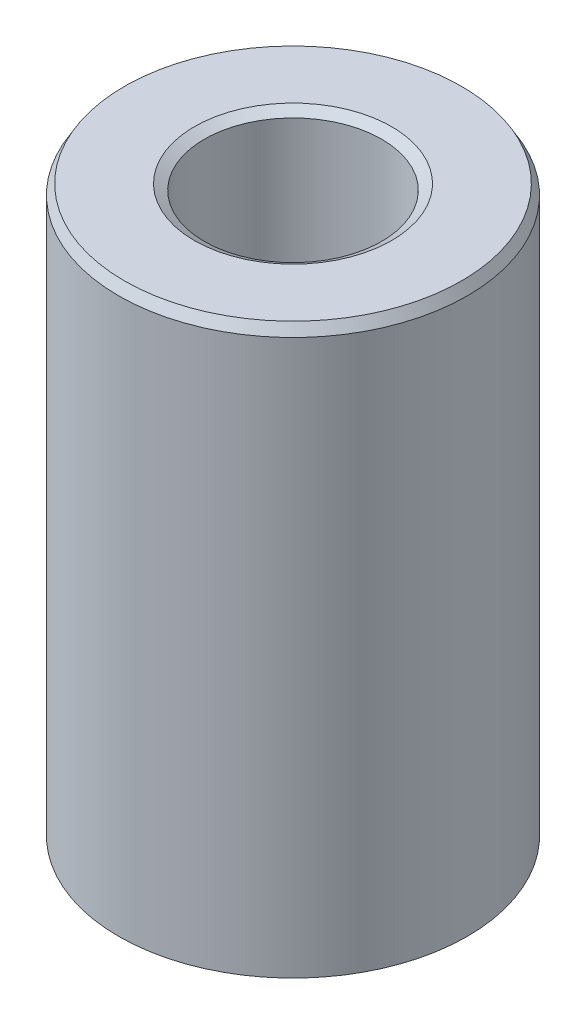
ISO-10303-21;
HEADER;
FILE_DESCRIPTION(('STEP AP214'),'2;1');
FILE_NAME('part.step','',(''),(''),'','','');
FILE_SCHEMA(('AUTOMOTIVE_DESIGN { 1 0 10303 214 1 1 1 1 }'));
ENDSEC;
DATA;
#1=APPLICATION_CONTEXT('core data for automotive mechanical design processes');
#2=APPLICATION_PROTOCOL_DEFINITION('international standard','automotive_design',2000,#1);
#3=PRODUCT_CONTEXT('',#1,'mechanical');
#4=PRODUCT('Part','Part','',(#3));
#5=PRODUCT_RELATED_PRODUCT_CATEGORY('part','',(#4));
#6=PRODUCT_DEFINITION_FORMATION('','',#4);
#7=PRODUCT_DEFINITION_CONTEXT('part definition',#1,'design');
#8=PRODUCT_DEFINITION('design','',#6,#7);
#9=PRODUCT_DEFINITION_SHAPE('','',#8);
#10=(LENGTH_UNIT() NAMED_UNIT(*) SI_UNIT(.MILLI.,.METRE.));
#11=(NAMED_UNIT(*) PLANE_ANGLE_UNIT() SI_UNIT($,.RADIAN.));
#12=(NAMED_UNIT(*) SI_UNIT($,.STERADIAN.) SOLID_ANGLE_UNIT());
#13=UNCERTAINTY_MEASURE_WITH_UNIT(LENGTH_MEASURE(1.E-05),#10,'distance_accuracy_value','');
#14=(GEOMETRIC_REPRESENTATION_CONTEXT(3) GLOBAL_UNCERTAINTY_ASSIGNED_CONTEXT((#13)) GLOBAL_UNIT_ASSIGNED_CONTEXT((#10,
#11,#12)) REPRESENTATION_CONTEXT('',''));
#15=CARTESIAN_POINT('',(0.,0.,0.));
#16=DIRECTION('',(0.,0.,1.));
#17=DIRECTION('',(1.,0.,0.));
#18=AXIS2_PLACEMENT_3D('',#15,#16,#17);
#19=CARTESIAN_POINT('',(0.,139.097010957514,0.));
#20=DIRECTION('',(0.,-1.,0.));
#21=DIRECTION('',(0.,0.,-1.));
#22=AXIS2_PLACEMENT_3D('',#19,#20,#21);
#23=CYLINDRICAL_SURFACE('',#22,42.5);
#24=CARTESIAN_POINT('',(0.,1.41226854131751,0.));
#25=DIRECTION('',(0.,1.,0.));
#26=DIRECTION('',(0.,0.,1.));
#27=AXIS2_PLACEMENT_3D('',#24,#25,#26);
#28=CIRCLE('',#27,42.5);
#29=CARTESIAN_POINT('',(0.,1.41226854131751,42.5));
#30=VERTEX_POINT('',#29);
#31=EDGE_CURVE('E10',#30,#30,#28,.T.);
#32=ORIENTED_EDGE('',*,*,#31,.T.);
#33=EDGE_LOOP('',(#32));
#34=FACE_BOUND('',#33,.T.);
#35=CARTESIAN_POINT('',(0.,136.65089009002,0.));
#36=DIRECTION('',(0.,1.,0.));
#37=DIRECTION('',(0.,0.,1.));
#38=AXIS2_PLACEMENT_3D('',#35,#36,#37);
#39=CIRCLE('',#38,42.5);
#40=CARTESIAN_POINT('',(0.,136.65089009002,42.5));
#41=VERTEX_POINT('',#40);
#42=EDGE_CURVE('E50',#41,#41,#39,.F.);
#43=ORIENTED_EDGE('',*,*,#42,.T.);
#44=EDGE_LOOP('',(#43));
#45=FACE_BOUND('',#44,.T.);
#46=ADVANCED_FACE('F39',(#34,#45),#23,.T.);
#47=CARTESIAN_POINT('',(0.,139.097010957514,0.));
#48=DIRECTION('',(0.,1.,0.));
#49=DIRECTION('',(0.,0.,1.));
#50=AXIS2_PLACEMENT_3D('',#47,#48,#49);
#51=PLANE('',#50);
#52=CARTESIAN_POINT('',(0.,139.097010957514,0.));
#53=DIRECTION('',(0.,1.,0.));
#54=DIRECTION('',(0.,0.,1.));
#55=AXIS2_PLACEMENT_3D('',#52,#53,#54);
#56=CIRCLE('',#55,24.0532483501111);
#57=CARTESIAN_POINT('',(0.,139.097010957514,24.0532483501111));
#58=VERTEX_POINT('',#57);
#59=EDGE_CURVE('E58',#58,#58,#56,.F.);
#60=ORIENTED_EDGE('',*,*,#59,.T.);
#61=EDGE_LOOP('',(#60));
#62=FACE_BOUND('',#61,.T.);
#63=CARTESIAN_POINT('',(0.,139.097010957514,0.));
#64=DIRECTION('',(0.,1.,0.));
#65=DIRECTION('',(0.,0.,1.));
#66=AXIS2_PLACEMENT_3D('',#63,#64,#65);
#67=CIRCLE('',#66,41.0877314586825);
#68=CARTESIAN_POINT('',(0.,139.097010957514,41.0877314586825));
#69=VERTEX_POINT('',#68);
#70=EDGE_CURVE('E61',#69,#69,#67,.T.);
#71=ORIENTED_EDGE('',*,*,#70,.T.);
#72=EDGE_LOOP('',(#71));
#73=FACE_BOUND('',#72,.T.);
#74=ADVANCED_FACE('F88',(#62,#73),#51,.T.);
#75=CARTESIAN_POINT('',(0.,0.,0.));
#76=DIRECTION('',(0.,1.,0.));
#77=DIRECTION('',(0.,0.,1.));
#78=AXIS2_PLACEMENT_3D('',#75,#76,#77);
#79=PLANE('',#78);
#80=CARTESIAN_POINT('',(0.,0.,0.));
#81=DIRECTION('',(0.,1.,0.));
#82=DIRECTION('',(0.,0.,1.));
#83=AXIS2_PLACEMENT_3D('',#80,#81,#82);
#84=CIRCLE('',#83,23.0193960239354);
#85=CARTESIAN_POINT('',(0.,0.,23.0193960239354));
#86=VERTEX_POINT('',#85);
#87=EDGE_CURVE('E51',#86,#86,#84,.T.);
#88=ORIENTED_EDGE('',*,*,#87,.T.);
#89=EDGE_LOOP('',(#88));
#90=FACE_BOUND('',#89,.T.);
#91=CARTESIAN_POINT('',(0.,0.,0.));
#92=DIRECTION('',(0.,1.,0.));
#93=DIRECTION('',(0.,0.,1.));
#94=AXIS2_PLACEMENT_3D('',#91,#92,#93);
#95=CIRCLE('',#94,40.0538791325069);
#96=CARTESIAN_POINT('',(0.,0.,40.0538791325069));
#97=VERTEX_POINT('',#96);
#98=EDGE_CURVE('E54',#97,#97,#95,.F.);
#99=ORIENTED_EDGE('',*,*,#98,.T.);
#100=EDGE_LOOP('',(#99));
#101=FACE_BOUND('',#100,.T.);
#102=ADVANCED_FACE('F83',(#90,#101),#79,.F.);
#103=CARTESIAN_POINT('',(0.,139.097010957514,0.));
#104=DIRECTION('',(0.,-1.,0.));
#105=DIRECTION('',(0.,0.,-1.));
#106=AXIS2_PLACEMENT_3D('',#103,#104,#105);
#107=CYLINDRICAL_SURFACE('',#106,21.607127482618);
#108=CARTESIAN_POINT('',(0.,137.684742416196,0.));
#109=DIRECTION('',(0.,1.,0.));
#110=DIRECTION('',(0.,0.,1.));
#111=AXIS2_PLACEMENT_3D('',#108,#109,#110);
#112=CIRCLE('',#111,21.607127482618);
#113=CARTESIAN_POINT('',(0.,137.684742416196,21.607127482618));
#114=VERTEX_POINT('',#113);
#115=EDGE_CURVE('E67',#114,#114,#112,.T.);
#116=ORIENTED_EDGE('',*,*,#115,.T.);
#117=EDGE_LOOP('',(#116));
#118=FACE_BOUND('',#117,.T.);
#119=CARTESIAN_POINT('',(0.,2.44612086749307,0.));
#120=DIRECTION('',(0.,1.,0.));
#121=DIRECTION('',(0.,0.,1.));
#122=AXIS2_PLACEMENT_3D('',#119,#120,#121);
#123=CIRCLE('',#122,21.607127482618);
#124=CARTESIAN_POINT('',(0.,2.44612086749307,21.607127482618));
#125=VERTEX_POINT('',#124);
#126=EDGE_CURVE('E69',#125,#125,#123,.F.);
#127=ORIENTED_EDGE('',*,*,#126,.T.);
#128=EDGE_LOOP('',(#127));
#129=FACE_BOUND('',#128,.T.);
#130=ADVANCED_FACE('F71',(#118,#129),#107,.F.);
#131=CARTESIAN_POINT('',(0.,137.684742416196,0.));
#132=DIRECTION('',(0.,1.,0.));
#133=DIRECTION('',(0.,0.,1.));
#134=AXIS2_PLACEMENT_3D('',#131,#132,#133);
#135=CONICAL_SURFACE('',#134,21.607127482618,1.0471975511966);
#136=ORIENTED_EDGE('',*,*,#59,.F.);
#137=EDGE_LOOP('',(#136));
#138=FACE_BOUND('',#137,.T.);
#139=ORIENTED_EDGE('',*,*,#115,.F.);
#140=EDGE_LOOP('',(#139));
#141=FACE_BOUND('',#140,.T.);
#142=ADVANCED_FACE('F77',(#138,#141),#135,.F.);
#143=CARTESIAN_POINT('',(0.,0.,0.));
#144=DIRECTION('',(0.,-1.,0.));
#145=DIRECTION('',(0.,0.,-1.));
#146=AXIS2_PLACEMENT_3D('',#143,#144,#145);
#147=CONICAL_SURFACE('',#146,23.0193960239354,0.523598775598296);
#148=ORIENTED_EDGE('',*,*,#126,.F.);
#149=EDGE_LOOP('',(#148));
#150=FACE_BOUND('',#149,.T.);
#151=ORIENTED_EDGE('',*,*,#87,.F.);
#152=EDGE_LOOP('',(#151));
#153=FACE_BOUND('',#152,.T.);
#154=ADVANCED_FACE('F73',(#150,#153),#147,.F.);
#155=CARTESIAN_POINT('',(0.,1.41226854131751,0.));
#156=DIRECTION('',(0.,1.,0.));
#157=DIRECTION('',(0.,0.,1.));
#158=AXIS2_PLACEMENT_3D('',#155,#156,#157);
#159=CONICAL_SURFACE('',#158,42.5,1.0471975511966);
#160=ORIENTED_EDGE('',*,*,#98,.F.);
#161=EDGE_LOOP('',(#160));
#162=FACE_BOUND('',#161,.T.);
#163=ORIENTED_EDGE('',*,*,#31,.F.);
#164=EDGE_LOOP('',(#163));
#165=FACE_BOUND('',#164,.T.);
#166=ADVANCED_FACE('F76',(#162,#165),#159,.T.);
#167=CARTESIAN_POINT('',(0.,139.097010957514,0.));
#168=DIRECTION('',(0.,-1.,0.));
#169=DIRECTION('',(0.,0.,-1.));
#170=AXIS2_PLACEMENT_3D('',#167,#168,#169);
#171=CONICAL_SURFACE('',#170,41.0877314586825,0.523598775598293);
#172=ORIENTED_EDGE('',*,*,#42,.F.);
#173=EDGE_LOOP('',(#172));
#174=FACE_BOUND('',#173,.T.);
#175=ORIENTED_EDGE('',*,*,#70,.F.);
#176=EDGE_LOOP('',(#175));
#177=FACE_BOUND('',#176,.T.);
#178=ADVANCED_FACE('F45',(#174,#177),#171,.T.);
#179=CLOSED_SHELL('',(#46,#74,#102,#130,#142,#154,#166,#178));
#180=MANIFOLD_SOLID_BREP('B2',#179);
#181=ADVANCED_BREP_SHAPE_REPRESENTATION('',(#18,#180),#14);
#182=SHAPE_DEFINITION_REPRESENTATION(#9,#181);
ENDSEC;
END-ISO-10303-21;
